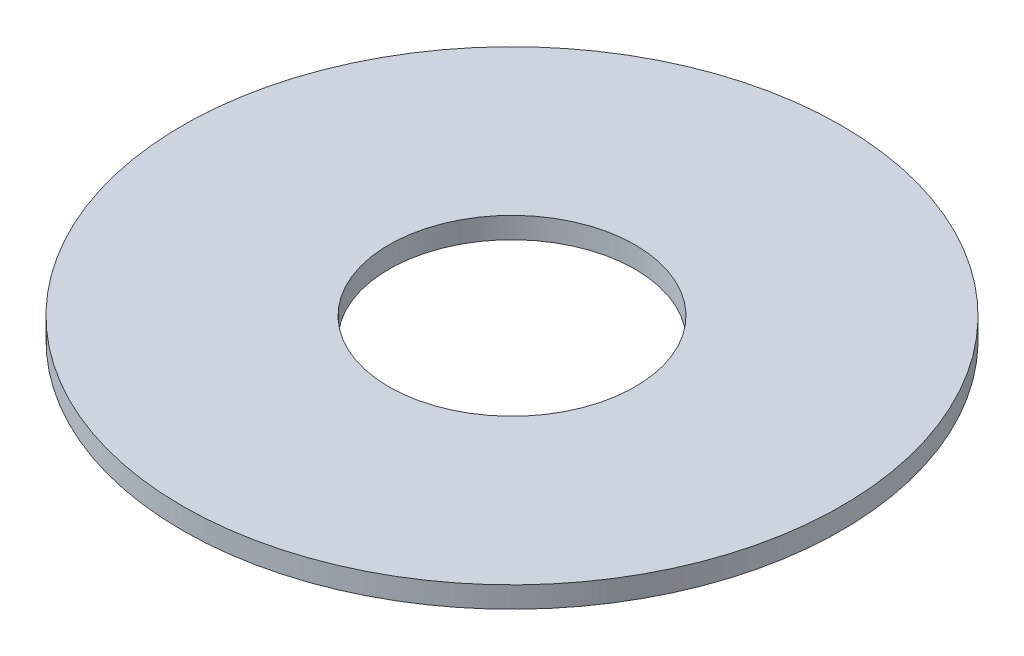
ISO-10303-21;
HEADER;
FILE_DESCRIPTION(('STEP AP214'),'2;1');
FILE_NAME('part.step','',(''),(''),'','','');
FILE_SCHEMA(('AUTOMOTIVE_DESIGN { 1 0 10303 214 1 1 1 1 }'));
ENDSEC;
DATA;
#1=APPLICATION_CONTEXT('core data for automotive mechanical design processes');
#2=APPLICATION_PROTOCOL_DEFINITION('international standard','automotive_design',2000,#1);
#3=PRODUCT_CONTEXT('',#1,'mechanical');
#4=PRODUCT('Part','Part','',(#3));
#5=PRODUCT_RELATED_PRODUCT_CATEGORY('part','',(#4));
#6=PRODUCT_DEFINITION_FORMATION('','',#4);
#7=PRODUCT_DEFINITION_CONTEXT('part definition',#1,'design');
#8=PRODUCT_DEFINITION('design','',#6,#7);
#9=PRODUCT_DEFINITION_SHAPE('','',#8);
#10=(LENGTH_UNIT() NAMED_UNIT(*) SI_UNIT(.MILLI.,.METRE.));
#11=(NAMED_UNIT(*) PLANE_ANGLE_UNIT() SI_UNIT($,.RADIAN.));
#12=(NAMED_UNIT(*) SI_UNIT($,.STERADIAN.) SOLID_ANGLE_UNIT());
#13=UNCERTAINTY_MEASURE_WITH_UNIT(LENGTH_MEASURE(1.E-05),#10,'distance_accuracy_value','');
#14=(GEOMETRIC_REPRESENTATION_CONTEXT(3) GLOBAL_UNCERTAINTY_ASSIGNED_CONTEXT((#13)) GLOBAL_UNIT_ASSIGNED_CONTEXT((#10,
#11,#12)) REPRESENTATION_CONTEXT('',''));
#15=CARTESIAN_POINT('',(0.,0.,0.));
#16=DIRECTION('',(0.,0.,1.));
#17=DIRECTION('',(1.,0.,0.));
#18=AXIS2_PLACEMENT_3D('',#15,#16,#17);
#19=CARTESIAN_POINT('',(0.,0.7112,0.));
#20=DIRECTION('',(0.,1.,0.));
#21=DIRECTION('',(0.,0.,1.));
#22=AXIS2_PLACEMENT_3D('',#19,#20,#21);
#23=PLANE('',#22);
#24=CARTESIAN_POINT('',(0.,0.7112,0.));
#25=DIRECTION('',(0.,1.,0.));
#26=DIRECTION('',(0.,0.,1.));
#27=AXIS2_PLACEMENT_3D('',#24,#25,#26);
#28=CIRCLE('',#27,11.0871);
#29=CARTESIAN_POINT('',(0.,0.7112,11.0871));
#30=VERTEX_POINT('',#29);
#31=EDGE_CURVE('E10',#30,#30,#28,.T.);
#32=ORIENTED_EDGE('',*,*,#31,.T.);
#33=EDGE_LOOP('',(#32));
#34=FACE_BOUND('',#33,.T.);
#35=CARTESIAN_POINT('',(0.,0.7112,0.));
#36=DIRECTION('',(0.,1.,0.));
#37=DIRECTION('',(0.,0.,1.));
#38=AXIS2_PLACEMENT_3D('',#35,#36,#37);
#39=CIRCLE('',#38,4.1402);
#40=CARTESIAN_POINT('',(0.,0.7112,4.1402));
#41=VERTEX_POINT('',#40);
#42=EDGE_CURVE('E44',#41,#41,#39,.T.);
#43=ORIENTED_EDGE('',*,*,#42,.F.);
#44=EDGE_LOOP('',(#43));
#45=FACE_BOUND('',#44,.T.);
#46=ADVANCED_FACE('F33',(#34,#45),#23,.T.);
#47=CARTESIAN_POINT('',(0.,0.,0.));
#48=DIRECTION('',(0.,1.,0.));
#49=DIRECTION('',(0.,0.,1.));
#50=AXIS2_PLACEMENT_3D('',#47,#48,#49);
#51=PLANE('',#50);
#52=CARTESIAN_POINT('',(0.,0.,0.));
#53=DIRECTION('',(0.,1.,0.));
#54=DIRECTION('',(0.,0.,1.));
#55=AXIS2_PLACEMENT_3D('',#52,#53,#54);
#56=CIRCLE('',#55,11.0871);
#57=CARTESIAN_POINT('',(0.,0.,11.0871));
#58=VERTEX_POINT('',#57);
#59=EDGE_CURVE('E37',#58,#58,#56,.T.);
#60=ORIENTED_EDGE('',*,*,#59,.F.);
#61=EDGE_LOOP('',(#60));
#62=FACE_BOUND('',#61,.T.);
#63=CARTESIAN_POINT('',(0.,0.,0.));
#64=DIRECTION('',(0.,1.,0.));
#65=DIRECTION('',(0.,0.,1.));
#66=AXIS2_PLACEMENT_3D('',#63,#64,#65);
#67=CIRCLE('',#66,4.1402);
#68=CARTESIAN_POINT('',(0.,0.,4.1402));
#69=VERTEX_POINT('',#68);
#70=EDGE_CURVE('E46',#69,#69,#67,.T.);
#71=ORIENTED_EDGE('',*,*,#70,.T.);
#72=EDGE_LOOP('',(#71));
#73=FACE_BOUND('',#72,.T.);
#74=ADVANCED_FACE('F56',(#62,#73),#51,.F.);
#75=CARTESIAN_POINT('',(0.,0.7112,0.));
#76=DIRECTION('',(0.,-1.,0.));
#77=DIRECTION('',(0.,0.,-1.));
#78=AXIS2_PLACEMENT_3D('',#75,#76,#77);
#79=CYLINDRICAL_SURFACE('',#78,11.0871);
#80=ORIENTED_EDGE('',*,*,#31,.F.);
#81=EDGE_LOOP('',(#80));
#82=FACE_BOUND('',#81,.T.);
#83=ORIENTED_EDGE('',*,*,#59,.T.);
#84=EDGE_LOOP('',(#83));
#85=FACE_BOUND('',#84,.T.);
#86=ADVANCED_FACE('F35',(#82,#85),#79,.T.);
#87=CARTESIAN_POINT('',(0.,0.7112,0.));
#88=DIRECTION('',(0.,-1.,0.));
#89=DIRECTION('',(0.,0.,-1.));
#90=AXIS2_PLACEMENT_3D('',#87,#88,#89);
#91=CYLINDRICAL_SURFACE('',#90,4.1402);
#92=ORIENTED_EDGE('',*,*,#42,.T.);
#93=EDGE_LOOP('',(#92));
#94=FACE_BOUND('',#93,.T.);
#95=ORIENTED_EDGE('',*,*,#70,.F.);
#96=EDGE_LOOP('',(#95));
#97=FACE_BOUND('',#96,.T.);
#98=ADVANCED_FACE('F52',(#94,#97),#91,.F.);
#99=CLOSED_SHELL('',(#46,#74,#86,#98));
#100=MANIFOLD_SOLID_BREP('B2',#99);
#101=ADVANCED_BREP_SHAPE_REPRESENTATION('',(#18,#100),#14);
#102=SHAPE_DEFINITION_REPRESENTATION(#9,#101);
ENDSEC;
END-ISO-10303-21;
